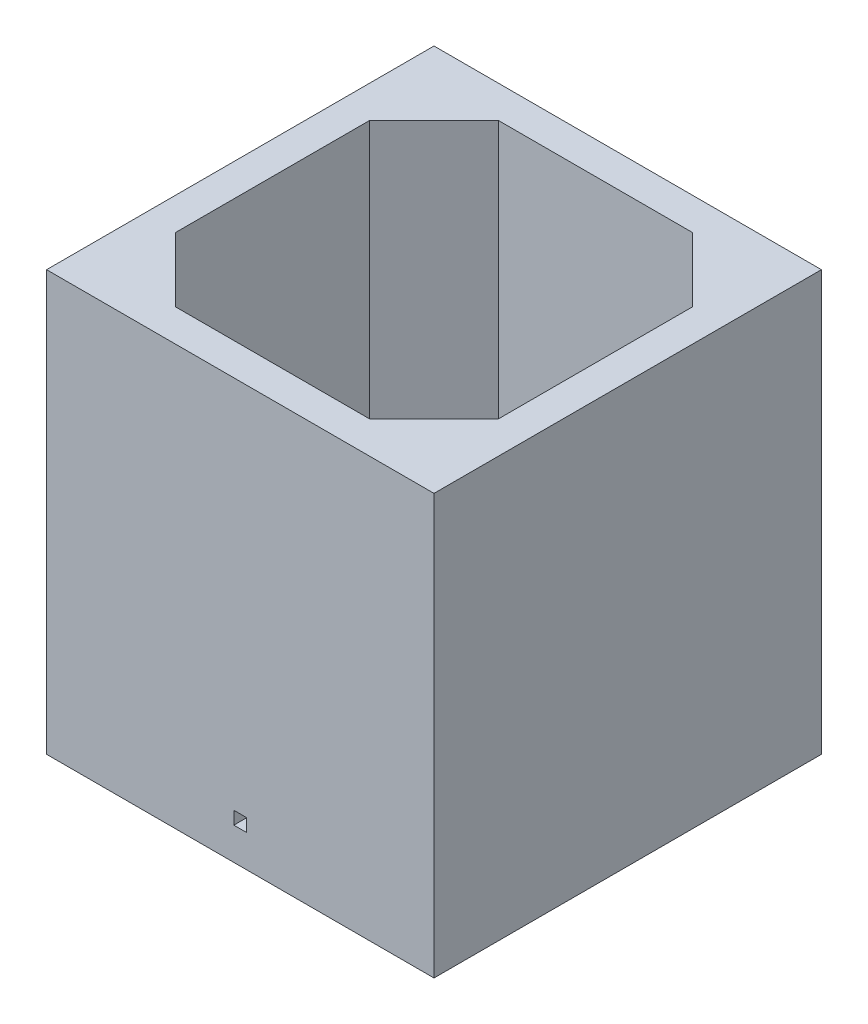
ISO-10303-21;
HEADER;
FILE_DESCRIPTION(('STEP AP214'),'2;1');
FILE_NAME('part.step','',(''),(''),'','','');
FILE_SCHEMA(('AUTOMOTIVE_DESIGN { 1 0 10303 214 1 1 1 1 }'));
ENDSEC;
DATA;
#1=APPLICATION_CONTEXT('core data for automotive mechanical design processes');
#2=APPLICATION_PROTOCOL_DEFINITION('international standard','automotive_design',2000,#1);
#3=PRODUCT_CONTEXT('',#1,'mechanical');
#4=PRODUCT('Part','Part','',(#3));
#5=PRODUCT_RELATED_PRODUCT_CATEGORY('part','',(#4));
#6=PRODUCT_DEFINITION_FORMATION('','',#4);
#7=PRODUCT_DEFINITION_CONTEXT('part definition',#1,'design');
#8=PRODUCT_DEFINITION('design','',#6,#7);
#9=PRODUCT_DEFINITION_SHAPE('','',#8);
#10=(LENGTH_UNIT() NAMED_UNIT(*) SI_UNIT(.MILLI.,.METRE.));
#11=(NAMED_UNIT(*) PLANE_ANGLE_UNIT() SI_UNIT($,.RADIAN.));
#12=(NAMED_UNIT(*) SI_UNIT($,.STERADIAN.) SOLID_ANGLE_UNIT());
#13=UNCERTAINTY_MEASURE_WITH_UNIT(LENGTH_MEASURE(1.E-05),#10,'distance_accuracy_value','');
#14=(GEOMETRIC_REPRESENTATION_CONTEXT(3) GLOBAL_UNCERTAINTY_ASSIGNED_CONTEXT((#13)) GLOBAL_UNIT_ASSIGNED_CONTEXT((#10,
#11,#12)) REPRESENTATION_CONTEXT('',''));
#15=CARTESIAN_POINT('',(0.,0.,0.));
#16=DIRECTION('',(0.,0.,1.));
#17=DIRECTION('',(1.,0.,0.));
#18=AXIS2_PLACEMENT_3D('',#15,#16,#17);
#19=CARTESIAN_POINT('',(0.,60.,0.));
#20=DIRECTION('',(0.,-1.,0.));
#21=DIRECTION('',(0.,0.,-1.));
#22=AXIS2_PLACEMENT_3D('',#19,#20,#21);
#23=PLANE('',#22);
#24=DIRECTION('',(0.,0.,-1.));
#25=VECTOR('',#24,1.);
#26=CARTESIAN_POINT('',(30.,60.,30.));
#27=LINE('',#26,#25);
#28=CARTESIAN_POINT('',(30.,60.,30.));
#29=VERTEX_POINT('',#28);
#30=CARTESIAN_POINT('',(30.,60.,-30.));
#31=VERTEX_POINT('',#30);
#32=EDGE_CURVE('E179',#29,#31,#27,.T.);
#33=ORIENTED_EDGE('',*,*,#32,.T.);
#34=DIRECTION('',(-1.,0.,0.));
#35=VECTOR('',#34,1.);
#36=CARTESIAN_POINT('',(-30.,60.,-30.));
#37=LINE('',#36,#35);
#38=CARTESIAN_POINT('',(-30.,60.,-30.));
#39=VERTEX_POINT('',#38);
#40=EDGE_CURVE('E182',#31,#39,#37,.T.);
#41=ORIENTED_EDGE('',*,*,#40,.T.);
#42=DIRECTION('',(0.,0.,1.));
#43=VECTOR('',#42,1.);
#44=CARTESIAN_POINT('',(-30.,60.,30.));
#45=LINE('',#44,#43);
#46=CARTESIAN_POINT('',(-30.,60.,30.));
#47=VERTEX_POINT('',#46);
#48=EDGE_CURVE('E185',#39,#47,#45,.T.);
#49=ORIENTED_EDGE('',*,*,#48,.T.);
#50=DIRECTION('',(1.,0.,0.));
#51=VECTOR('',#50,1.);
#52=CARTESIAN_POINT('',(-30.,60.,30.));
#53=LINE('',#52,#51);
#54=EDGE_CURVE('E187',#47,#29,#53,.T.);
#55=ORIENTED_EDGE('',*,*,#54,.T.);
#56=EDGE_LOOP('',(#33,#41,#49,#55));
#57=FACE_BOUND('',#56,.T.);
#58=DIRECTION('',(0.,0.,-1.));
#59=VECTOR('',#58,1.);
#60=CARTESIAN_POINT('',(25.,60.,25.));
#61=LINE('',#60,#59);
#62=CARTESIAN_POINT('',(25.,60.,15.));
#63=VERTEX_POINT('',#62);
#64=CARTESIAN_POINT('',(25.,60.,-14.9999999999999));
#65=VERTEX_POINT('',#64);
#66=EDGE_CURVE('E169',#63,#65,#61,.T.);
#67=ORIENTED_EDGE('',*,*,#66,.F.);
#68=DIRECTION('',(0.707106781186551,0.,-0.707106781186544));
#69=VECTOR('',#68,1.);
#70=CARTESIAN_POINT('',(19.9999999999999,60.,20.0000000000001));
#71=LINE('',#70,#69);
#72=CARTESIAN_POINT('',(14.9999999999999,60.,25.));
#73=VERTEX_POINT('',#72);
#74=EDGE_CURVE('E11',#63,#73,#71,.F.);
#75=ORIENTED_EDGE('',*,*,#74,.T.);
#76=DIRECTION('',(1.,0.,0.));
#77=VECTOR('',#76,1.);
#78=CARTESIAN_POINT('',(-25.,60.,25.));
#79=LINE('',#78,#77);
#80=CARTESIAN_POINT('',(-15.,60.,25.));
#81=VERTEX_POINT('',#80);
#82=EDGE_CURVE('E183',#81,#73,#79,.T.);
#83=ORIENTED_EDGE('',*,*,#82,.F.);
#84=DIRECTION('',(0.707106781186544,0.,0.707106781186551));
#85=VECTOR('',#84,1.);
#86=CARTESIAN_POINT('',(-20.0000000000001,60.,19.9999999999999));
#87=LINE('',#86,#85);
#88=CARTESIAN_POINT('',(-25.,60.,14.9999999999999));
#89=VERTEX_POINT('',#88);
#90=EDGE_CURVE('E224',#81,#89,#87,.F.);
#91=ORIENTED_EDGE('',*,*,#90,.T.);
#92=DIRECTION('',(0.,0.,1.));
#93=VECTOR('',#92,1.);
#94=CARTESIAN_POINT('',(-25.,60.,25.));
#95=LINE('',#94,#93);
#96=CARTESIAN_POINT('',(-25.,60.,-15.));
#97=VERTEX_POINT('',#96);
#98=EDGE_CURVE('E254',#97,#89,#95,.T.);
#99=ORIENTED_EDGE('',*,*,#98,.F.);
#100=DIRECTION('',(-0.707106781186551,0.,0.707106781186544));
#101=VECTOR('',#100,1.);
#102=CARTESIAN_POINT('',(-19.9999999999999,60.,-20.0000000000001));
#103=LINE('',#102,#101);
#104=CARTESIAN_POINT('',(-14.9999999999999,60.,-25.));
#105=VERTEX_POINT('',#104);
#106=EDGE_CURVE('E226',#97,#105,#103,.F.);
#107=ORIENTED_EDGE('',*,*,#106,.T.);
#108=DIRECTION('',(-1.,0.,0.));
#109=VECTOR('',#108,1.);
#110=CARTESIAN_POINT('',(-25.,60.,-25.));
#111=LINE('',#110,#109);
#112=CARTESIAN_POINT('',(15.,60.,-25.));
#113=VERTEX_POINT('',#112);
#114=EDGE_CURVE('E173',#113,#105,#111,.T.);
#115=ORIENTED_EDGE('',*,*,#114,.F.);
#116=DIRECTION('',(-0.707106781186544,0.,-0.707106781186551));
#117=VECTOR('',#116,1.);
#118=CARTESIAN_POINT('',(20.0000000000001,60.,-19.9999999999999));
#119=LINE('',#118,#117);
#120=EDGE_CURVE('E44',#113,#65,#119,.F.);
#121=ORIENTED_EDGE('',*,*,#120,.T.);
#122=EDGE_LOOP('',(#67,#75,#83,#91,#99,#107,#115,#121));
#123=FACE_BOUND('',#122,.T.);
#124=ADVANCED_FACE('F35',(#57,#123),#23,.F.);
#125=CARTESIAN_POINT('',(30.,60.,30.));
#126=DIRECTION('',(-1.,0.,0.));
#127=DIRECTION('',(0.,0.,1.));
#128=AXIS2_PLACEMENT_3D('',#125,#126,#127);
#129=PLANE('',#128);
#130=DIRECTION('',(0.,-1.,0.));
#131=VECTOR('',#130,1.);
#132=CARTESIAN_POINT('',(30.,60.,30.));
#133=LINE('',#132,#131);
#134=CARTESIAN_POINT('',(30.,-5.,30.));
#135=VERTEX_POINT('',#134);
#136=EDGE_CURVE('E189',#29,#135,#133,.T.);
#137=ORIENTED_EDGE('',*,*,#136,.T.);
#138=DIRECTION('',(0.,0.,1.));
#139=VECTOR('',#138,1.);
#140=CARTESIAN_POINT('',(30.,-5.,-30.));
#141=LINE('',#140,#139);
#142=CARTESIAN_POINT('',(30.,-5.,-30.));
#143=VERTEX_POINT('',#142);
#144=EDGE_CURVE('E266',#143,#135,#141,.T.);
#145=ORIENTED_EDGE('',*,*,#144,.F.);
#146=DIRECTION('',(0.,-1.,0.));
#147=VECTOR('',#146,1.);
#148=CARTESIAN_POINT('',(30.,60.,-30.));
#149=LINE('',#148,#147);
#150=EDGE_CURVE('E195',#31,#143,#149,.T.);
#151=ORIENTED_EDGE('',*,*,#150,.F.);
#152=ORIENTED_EDGE('',*,*,#32,.F.);
#153=EDGE_LOOP('',(#137,#145,#151,#152));
#154=FACE_BOUND('',#153,.T.);
#155=ADVANCED_FACE('F329',(#154),#129,.F.);
#156=CARTESIAN_POINT('',(-30.,60.,-30.));
#157=DIRECTION('',(0.,0.,1.));
#158=DIRECTION('',(1.,0.,0.));
#159=AXIS2_PLACEMENT_3D('',#156,#157,#158);
#160=PLANE('',#159);
#161=CARTESIAN_POINT('',(13.1765280058509,8.1,-30.));
#162=DIRECTION('',(0.,0.,-1.));
#163=DIRECTION('',(-1.,0.,0.));
#164=AXIS2_PLACEMENT_3D('',#161,#162,#163);
#165=CIRCLE('',#164,1.25);
#166=CARTESIAN_POINT('',(11.9265280058509,8.1,-30.));
#167=VERTEX_POINT('',#166);
#168=EDGE_CURVE('E277',#167,#167,#165,.T.);
#169=ORIENTED_EDGE('',*,*,#168,.F.);
#170=EDGE_LOOP('',(#169));
#171=FACE_BOUND('',#170,.T.);
#172=CARTESIAN_POINT('',(0.,2.5,-30.));
#173=DIRECTION('',(0.,0.,-1.));
#174=DIRECTION('',(-1.,0.,0.));
#175=AXIS2_PLACEMENT_3D('',#172,#173,#174);
#176=CIRCLE('',#175,1.25);
#177=CARTESIAN_POINT('',(-1.24999999999999,2.5,-30.));
#178=VERTEX_POINT('',#177);
#179=EDGE_CURVE('E273',#178,#178,#176,.T.);
#180=ORIENTED_EDGE('',*,*,#179,.F.);
#181=EDGE_LOOP('',(#180));
#182=FACE_BOUND('',#181,.T.);
#183=CARTESIAN_POINT('',(0.,8.1,-30.));
#184=DIRECTION('',(0.,0.,-1.));
#185=DIRECTION('',(-1.,0.,0.));
#186=AXIS2_PLACEMENT_3D('',#183,#184,#185);
#187=CIRCLE('',#186,1.25);
#188=CARTESIAN_POINT('',(-1.24999999999999,8.1,-30.));
#189=VERTEX_POINT('',#188);
#190=EDGE_CURVE('E274',#189,#189,#187,.T.);
#191=ORIENTED_EDGE('',*,*,#190,.F.);
#192=EDGE_LOOP('',(#191));
#193=FACE_BOUND('',#192,.T.);
#194=ORIENTED_EDGE('',*,*,#150,.T.);
#195=DIRECTION('',(1.,0.,0.));
#196=VECTOR('',#195,1.);
#197=CARTESIAN_POINT('',(-30.,-5.,-30.));
#198=LINE('',#197,#196);
#199=CARTESIAN_POINT('',(-30.,-5.,-30.));
#200=VERTEX_POINT('',#199);
#201=EDGE_CURVE('E249',#200,#143,#198,.T.);
#202=ORIENTED_EDGE('',*,*,#201,.F.);
#203=DIRECTION('',(0.,-1.,0.));
#204=VECTOR('',#203,1.);
#205=CARTESIAN_POINT('',(-30.,60.,-30.));
#206=LINE('',#205,#204);
#207=EDGE_CURVE('E193',#39,#200,#206,.T.);
#208=ORIENTED_EDGE('',*,*,#207,.F.);
#209=ORIENTED_EDGE('',*,*,#40,.F.);
#210=EDGE_LOOP('',(#194,#202,#208,#209));
#211=FACE_BOUND('',#210,.T.);
#212=ADVANCED_FACE('F326',(#171,#182,#193,#211),#160,.F.);
#213=CARTESIAN_POINT('',(-30.,60.,30.));
#214=DIRECTION('',(1.,0.,0.));
#215=DIRECTION('',(0.,0.,-1.));
#216=AXIS2_PLACEMENT_3D('',#213,#214,#215);
#217=PLANE('',#216);
#218=ORIENTED_EDGE('',*,*,#207,.T.);
#219=DIRECTION('',(0.,0.,-1.));
#220=VECTOR('',#219,1.);
#221=CARTESIAN_POINT('',(-30.,-5.,-30.));
#222=LINE('',#221,#220);
#223=CARTESIAN_POINT('',(-30.,-5.,30.));
#224=VERTEX_POINT('',#223);
#225=EDGE_CURVE('E260',#224,#200,#222,.T.);
#226=ORIENTED_EDGE('',*,*,#225,.F.);
#227=DIRECTION('',(0.,-1.,0.));
#228=VECTOR('',#227,1.);
#229=CARTESIAN_POINT('',(-30.,60.,30.));
#230=LINE('',#229,#228);
#231=EDGE_CURVE('E191',#47,#224,#230,.T.);
#232=ORIENTED_EDGE('',*,*,#231,.F.);
#233=ORIENTED_EDGE('',*,*,#48,.F.);
#234=EDGE_LOOP('',(#218,#226,#232,#233));
#235=FACE_BOUND('',#234,.T.);
#236=ADVANCED_FACE('F311',(#235),#217,.F.);
#237=CARTESIAN_POINT('',(-30.,60.,30.));
#238=DIRECTION('',(0.,0.,-1.));
#239=DIRECTION('',(-1.,0.,0.));
#240=AXIS2_PLACEMENT_3D('',#237,#238,#239);
#241=PLANE('',#240);
#242=DIRECTION('',(0.,1.,0.));
#243=VECTOR('',#242,1.);
#244=CARTESIAN_POINT('',(1.,0.,30.));
#245=LINE('',#244,#243);
#246=CARTESIAN_POINT('',(1.,0.,30.));
#247=VERTEX_POINT('',#246);
#248=CARTESIAN_POINT('',(1.,2.,30.));
#249=VERTEX_POINT('',#248);
#250=EDGE_CURVE('E293',#247,#249,#245,.T.);
#251=ORIENTED_EDGE('',*,*,#250,.F.);
#252=DIRECTION('',(1.,0.,0.));
#253=VECTOR('',#252,1.);
#254=CARTESIAN_POINT('',(-0.999999999999999,0.,30.));
#255=LINE('',#254,#253);
#256=CARTESIAN_POINT('',(-0.999999999999999,0.,30.));
#257=VERTEX_POINT('',#256);
#258=EDGE_CURVE('E296',#257,#247,#255,.T.);
#259=ORIENTED_EDGE('',*,*,#258,.F.);
#260=DIRECTION('',(0.,-1.,0.));
#261=VECTOR('',#260,1.);
#262=CARTESIAN_POINT('',(-0.999999999999999,0.,30.));
#263=LINE('',#262,#261);
#264=CARTESIAN_POINT('',(-1.,2.,30.));
#265=VERTEX_POINT('',#264);
#266=EDGE_CURVE('E153',#265,#257,#263,.T.);
#267=ORIENTED_EDGE('',*,*,#266,.F.);
#268=DIRECTION('',(-1.,0.,0.));
#269=VECTOR('',#268,1.);
#270=CARTESIAN_POINT('',(-1.,2.,30.));
#271=LINE('',#270,#269);
#272=EDGE_CURVE('E51',#249,#265,#271,.T.);
#273=ORIENTED_EDGE('',*,*,#272,.F.);
#274=EDGE_LOOP('',(#251,#259,#267,#273));
#275=FACE_BOUND('',#274,.T.);
#276=ORIENTED_EDGE('',*,*,#231,.T.);
#277=DIRECTION('',(-1.,0.,0.));
#278=VECTOR('',#277,1.);
#279=CARTESIAN_POINT('',(-30.,-5.,30.));
#280=LINE('',#279,#278);
#281=EDGE_CURVE('E263',#135,#224,#280,.T.);
#282=ORIENTED_EDGE('',*,*,#281,.F.);
#283=ORIENTED_EDGE('',*,*,#136,.F.);
#284=ORIENTED_EDGE('',*,*,#54,.F.);
#285=EDGE_LOOP('',(#276,#282,#283,#284));
#286=FACE_BOUND('',#285,.T.);
#287=ADVANCED_FACE('F308',(#275,#286),#241,.F.);
#288=CARTESIAN_POINT('',(25.,60.,25.));
#289=DIRECTION('',(-1.,0.,0.));
#290=DIRECTION('',(0.,0.,1.));
#291=AXIS2_PLACEMENT_3D('',#288,#289,#290);
#292=PLANE('',#291);
#293=ORIENTED_EDGE('',*,*,#66,.T.);
#294=DIRECTION('',(0.,-1.,0.));
#295=VECTOR('',#294,1.);
#296=CARTESIAN_POINT('',(25.,0.,-14.9999999999999));
#297=LINE('',#296,#295);
#298=CARTESIAN_POINT('',(25.,0.,-14.9999999999999));
#299=VERTEX_POINT('',#298);
#300=EDGE_CURVE('E221',#65,#299,#297,.T.);
#301=ORIENTED_EDGE('',*,*,#300,.T.);
#302=DIRECTION('',(0.,0.,-1.));
#303=VECTOR('',#302,1.);
#304=CARTESIAN_POINT('',(25.,0.,25.));
#305=LINE('',#304,#303);
#306=CARTESIAN_POINT('',(25.,0.,15.));
#307=VERTEX_POINT('',#306);
#308=EDGE_CURVE('E245',#307,#299,#305,.T.);
#309=ORIENTED_EDGE('',*,*,#308,.F.);
#310=DIRECTION('',(0.,1.,0.));
#311=VECTOR('',#310,1.);
#312=CARTESIAN_POINT('',(25.,60.,15.));
#313=LINE('',#312,#311);
#314=EDGE_CURVE('E219',#307,#63,#313,.T.);
#315=ORIENTED_EDGE('',*,*,#314,.T.);
#316=EDGE_LOOP('',(#293,#301,#309,#315));
#317=FACE_BOUND('',#316,.T.);
#318=ADVANCED_FACE('F237',(#317),#292,.T.);
#319=CARTESIAN_POINT('',(-25.,60.,-25.));
#320=DIRECTION('',(0.,0.,1.));
#321=DIRECTION('',(1.,0.,0.));
#322=AXIS2_PLACEMENT_3D('',#319,#320,#321);
#323=PLANE('',#322);
#324=CARTESIAN_POINT('',(13.1765280058509,8.1,-25.));
#325=DIRECTION('',(0.,0.,1.));
#326=DIRECTION('',(1.,0.,0.));
#327=AXIS2_PLACEMENT_3D('',#324,#325,#326);
#328=CIRCLE('',#327,1.25);
#329=CARTESIAN_POINT('',(14.4265280058509,8.1,-25.));
#330=VERTEX_POINT('',#329);
#331=EDGE_CURVE('E284',#330,#330,#328,.F.);
#332=ORIENTED_EDGE('',*,*,#331,.T.);
#333=EDGE_LOOP('',(#332));
#334=FACE_BOUND('',#333,.T.);
#335=CARTESIAN_POINT('',(0.,2.5,-25.));
#336=DIRECTION('',(0.,0.,1.));
#337=DIRECTION('',(1.,0.,0.));
#338=AXIS2_PLACEMENT_3D('',#335,#336,#337);
#339=CIRCLE('',#338,1.25);
#340=CARTESIAN_POINT('',(1.25000000000001,2.5,-25.));
#341=VERTEX_POINT('',#340);
#342=EDGE_CURVE('E269',#341,#341,#339,.F.);
#343=ORIENTED_EDGE('',*,*,#342,.T.);
#344=EDGE_LOOP('',(#343));
#345=FACE_BOUND('',#344,.T.);
#346=CARTESIAN_POINT('',(0.,8.1,-25.));
#347=DIRECTION('',(0.,0.,1.));
#348=DIRECTION('',(1.,0.,0.));
#349=AXIS2_PLACEMENT_3D('',#346,#347,#348);
#350=CIRCLE('',#349,1.25);
#351=CARTESIAN_POINT('',(1.25000000000001,8.1,-25.));
#352=VERTEX_POINT('',#351);
#353=EDGE_CURVE('E270',#352,#352,#350,.F.);
#354=ORIENTED_EDGE('',*,*,#353,.T.);
#355=EDGE_LOOP('',(#354));
#356=FACE_BOUND('',#355,.T.);
#357=ORIENTED_EDGE('',*,*,#114,.T.);
#358=DIRECTION('',(0.,-1.,0.));
#359=VECTOR('',#358,1.);
#360=CARTESIAN_POINT('',(-14.9999999999999,0.,-25.));
#361=LINE('',#360,#359);
#362=CARTESIAN_POINT('',(-14.9999999999999,0.,-25.));
#363=VERTEX_POINT('',#362);
#364=EDGE_CURVE('E216',#105,#363,#361,.T.);
#365=ORIENTED_EDGE('',*,*,#364,.T.);
#366=DIRECTION('',(-1.,0.,0.));
#367=VECTOR('',#366,1.);
#368=CARTESIAN_POINT('',(-25.,0.,-25.));
#369=LINE('',#368,#367);
#370=CARTESIAN_POINT('',(15.,0.,-25.));
#371=VERTEX_POINT('',#370);
#372=EDGE_CURVE('E244',#371,#363,#369,.T.);
#373=ORIENTED_EDGE('',*,*,#372,.F.);
#374=DIRECTION('',(0.,1.,0.));
#375=VECTOR('',#374,1.);
#376=CARTESIAN_POINT('',(15.,60.,-25.));
#377=LINE('',#376,#375);
#378=EDGE_CURVE('E214',#371,#113,#377,.T.);
#379=ORIENTED_EDGE('',*,*,#378,.T.);
#380=EDGE_LOOP('',(#357,#365,#373,#379));
#381=FACE_BOUND('',#380,.T.);
#382=ADVANCED_FACE('F247',(#334,#345,#356,#381),#323,.T.);
#383=CARTESIAN_POINT('',(-25.,60.,25.));
#384=DIRECTION('',(1.,0.,0.));
#385=DIRECTION('',(0.,0.,-1.));
#386=AXIS2_PLACEMENT_3D('',#383,#384,#385);
#387=PLANE('',#386);
#388=ORIENTED_EDGE('',*,*,#98,.T.);
#389=DIRECTION('',(0.,-1.,0.));
#390=VECTOR('',#389,1.);
#391=CARTESIAN_POINT('',(-25.,0.,14.9999999999999));
#392=LINE('',#391,#390);
#393=CARTESIAN_POINT('',(-25.,0.,14.9999999999999));
#394=VERTEX_POINT('',#393);
#395=EDGE_CURVE('E199',#89,#394,#392,.T.);
#396=ORIENTED_EDGE('',*,*,#395,.T.);
#397=DIRECTION('',(0.,0.,1.));
#398=VECTOR('',#397,1.);
#399=CARTESIAN_POINT('',(-25.,0.,25.));
#400=LINE('',#399,#398);
#401=CARTESIAN_POINT('',(-25.,0.,-15.));
#402=VERTEX_POINT('',#401);
#403=EDGE_CURVE('E175',#402,#394,#400,.T.);
#404=ORIENTED_EDGE('',*,*,#403,.F.);
#405=DIRECTION('',(0.,1.,0.));
#406=VECTOR('',#405,1.);
#407=CARTESIAN_POINT('',(-25.,60.,-15.));
#408=LINE('',#407,#406);
#409=EDGE_CURVE('E197',#402,#97,#408,.T.);
#410=ORIENTED_EDGE('',*,*,#409,.T.);
#411=EDGE_LOOP('',(#388,#396,#404,#410));
#412=FACE_BOUND('',#411,.T.);
#413=ADVANCED_FACE('F382',(#412),#387,.T.);
#414=CARTESIAN_POINT('',(-25.,60.,25.));
#415=DIRECTION('',(0.,0.,-1.));
#416=DIRECTION('',(-1.,0.,0.));
#417=AXIS2_PLACEMENT_3D('',#414,#415,#416);
#418=PLANE('',#417);
#419=DIRECTION('',(0.,1.,0.));
#420=VECTOR('',#419,1.);
#421=CARTESIAN_POINT('',(1.,0.,25.));
#422=LINE('',#421,#420);
#423=CARTESIAN_POINT('',(1.,0.,25.));
#424=VERTEX_POINT('',#423);
#425=CARTESIAN_POINT('',(1.,2.,25.));
#426=VERTEX_POINT('',#425);
#427=EDGE_CURVE('E300',#424,#426,#422,.T.);
#428=ORIENTED_EDGE('',*,*,#427,.T.);
#429=DIRECTION('',(-1.,0.,0.));
#430=VECTOR('',#429,1.);
#431=CARTESIAN_POINT('',(-1.,2.,25.));
#432=LINE('',#431,#430);
#433=CARTESIAN_POINT('',(-1.,2.,25.));
#434=VERTEX_POINT('',#433);
#435=EDGE_CURVE('E164',#426,#434,#432,.T.);
#436=ORIENTED_EDGE('',*,*,#435,.T.);
#437=DIRECTION('',(0.,-1.,0.));
#438=VECTOR('',#437,1.);
#439=CARTESIAN_POINT('',(-0.999999999999999,0.,25.));
#440=LINE('',#439,#438);
#441=CARTESIAN_POINT('',(-0.999999999999997,0.,25.));
#442=VERTEX_POINT('',#441);
#443=EDGE_CURVE('E151',#434,#442,#440,.T.);
#444=ORIENTED_EDGE('',*,*,#443,.T.);
#445=DIRECTION('',(1.,0.,0.));
#446=VECTOR('',#445,1.);
#447=CARTESIAN_POINT('',(-25.,0.,25.));
#448=LINE('',#447,#446);
#449=CARTESIAN_POINT('',(-15.,0.,25.));
#450=VERTEX_POINT('',#449);
#451=EDGE_CURVE('E162',#450,#442,#448,.T.);
#452=ORIENTED_EDGE('',*,*,#451,.F.);
#453=DIRECTION('',(0.,1.,0.));
#454=VECTOR('',#453,1.);
#455=CARTESIAN_POINT('',(-15.,60.,25.));
#456=LINE('',#455,#454);
#457=EDGE_CURVE('E212',#450,#81,#456,.T.);
#458=ORIENTED_EDGE('',*,*,#457,.T.);
#459=ORIENTED_EDGE('',*,*,#82,.T.);
#460=DIRECTION('',(0.,-1.,0.));
#461=VECTOR('',#460,1.);
#462=CARTESIAN_POINT('',(14.9999999999999,0.,25.));
#463=LINE('',#462,#461);
#464=CARTESIAN_POINT('',(14.9999999999999,0.,25.));
#465=VERTEX_POINT('',#464);
#466=EDGE_CURVE('E209',#73,#465,#463,.T.);
#467=ORIENTED_EDGE('',*,*,#466,.T.);
#468=EDGE_CURVE('E170',#424,#465,#448,.T.);
#469=ORIENTED_EDGE('',*,*,#468,.F.);
#470=EDGE_LOOP('',(#428,#436,#444,#452,#458,#459,#467,#469));
#471=FACE_BOUND('',#470,.T.);
#472=ADVANCED_FACE('F161',(#471),#418,.T.);
#473=CARTESIAN_POINT('',(0.,0.,0.));
#474=DIRECTION('',(0.,1.,0.));
#475=DIRECTION('',(0.,0.,1.));
#476=AXIS2_PLACEMENT_3D('',#473,#474,#475);
#477=PLANE('',#476);
#478=ORIENTED_EDGE('',*,*,#403,.T.);
#479=DIRECTION('',(-0.707106781186544,0.,-0.707106781186551));
#480=VECTOR('',#479,1.);
#481=CARTESIAN_POINT('',(-20.0000000000001,0.,19.9999999999999));
#482=LINE('',#481,#480);
#483=EDGE_CURVE('E168',#394,#450,#482,.F.);
#484=ORIENTED_EDGE('',*,*,#483,.T.);
#485=ORIENTED_EDGE('',*,*,#451,.T.);
#486=DIRECTION('',(0.,0.,1.));
#487=VECTOR('',#486,1.);
#488=CARTESIAN_POINT('',(-0.999999999999999,0.,-30.001));
#489=LINE('',#488,#487);
#490=EDGE_CURVE('E148',#442,#257,#489,.T.);
#491=ORIENTED_EDGE('',*,*,#490,.T.);
#492=ORIENTED_EDGE('',*,*,#258,.T.);
#493=DIRECTION('',(0.,0.,1.));
#494=VECTOR('',#493,1.);
#495=CARTESIAN_POINT('',(1.,0.,-30.001));
#496=LINE('',#495,#494);
#497=EDGE_CURVE('E59',#424,#247,#496,.T.);
#498=ORIENTED_EDGE('',*,*,#497,.F.);
#499=ORIENTED_EDGE('',*,*,#468,.T.);
#500=DIRECTION('',(-0.707106781186551,0.,0.707106781186544));
#501=VECTOR('',#500,1.);
#502=CARTESIAN_POINT('',(19.9999999999999,0.,20.0000000000001));
#503=LINE('',#502,#501);
#504=EDGE_CURVE('E202',#465,#307,#503,.F.);
#505=ORIENTED_EDGE('',*,*,#504,.T.);
#506=ORIENTED_EDGE('',*,*,#308,.T.);
#507=DIRECTION('',(0.707106781186544,0.,0.707106781186551));
#508=VECTOR('',#507,1.);
#509=CARTESIAN_POINT('',(20.0000000000001,0.,-19.9999999999999));
#510=LINE('',#509,#508);
#511=EDGE_CURVE('E204',#299,#371,#510,.F.);
#512=ORIENTED_EDGE('',*,*,#511,.T.);
#513=ORIENTED_EDGE('',*,*,#372,.T.);
#514=DIRECTION('',(0.707106781186551,0.,-0.707106781186544));
#515=VECTOR('',#514,1.);
#516=CARTESIAN_POINT('',(-19.9999999999999,0.,-20.0000000000001));
#517=LINE('',#516,#515);
#518=EDGE_CURVE('E206',#363,#402,#517,.F.);
#519=ORIENTED_EDGE('',*,*,#518,.T.);
#520=EDGE_LOOP('',(#478,#484,#485,#491,#492,#498,#499,#505,#506,#512,#513,#519));
#521=FACE_BOUND('',#520,.T.);
#522=ADVANCED_FACE('F167',(#521),#477,.T.);
#523=CARTESIAN_POINT('',(0.,-5.,0.));
#524=DIRECTION('',(0.,1.,0.));
#525=DIRECTION('',(0.,0.,1.));
#526=AXIS2_PLACEMENT_3D('',#523,#524,#525);
#527=PLANE('',#526);
#528=ORIENTED_EDGE('',*,*,#144,.T.);
#529=ORIENTED_EDGE('',*,*,#281,.T.);
#530=ORIENTED_EDGE('',*,*,#225,.T.);
#531=ORIENTED_EDGE('',*,*,#201,.T.);
#532=EDGE_LOOP('',(#528,#529,#530,#531));
#533=FACE_BOUND('',#532,.T.);
#534=ADVANCED_FACE('F321',(#533),#527,.F.);
#535=CARTESIAN_POINT('',(0.,8.1,-21.4644660940673));
#536=DIRECTION('',(0.,0.,-1.));
#537=DIRECTION('',(-1.,0.,0.));
#538=AXIS2_PLACEMENT_3D('',#535,#536,#537);
#539=CYLINDRICAL_SURFACE('',#538,1.25);
#540=ORIENTED_EDGE('',*,*,#190,.T.);
#541=EDGE_LOOP('',(#540));
#542=FACE_BOUND('',#541,.T.);
#543=ORIENTED_EDGE('',*,*,#353,.F.);
#544=EDGE_LOOP('',(#543));
#545=FACE_BOUND('',#544,.T.);
#546=ADVANCED_FACE('F399',(#542,#545),#539,.F.);
#547=CARTESIAN_POINT('',(0.,2.5,-21.4644660940673));
#548=DIRECTION('',(0.,0.,-1.));
#549=DIRECTION('',(-1.,0.,0.));
#550=AXIS2_PLACEMENT_3D('',#547,#548,#549);
#551=CYLINDRICAL_SURFACE('',#550,1.25);
#552=ORIENTED_EDGE('',*,*,#179,.T.);
#553=EDGE_LOOP('',(#552));
#554=FACE_BOUND('',#553,.T.);
#555=ORIENTED_EDGE('',*,*,#342,.F.);
#556=EDGE_LOOP('',(#555));
#557=FACE_BOUND('',#556,.T.);
#558=ADVANCED_FACE('F402',(#554,#557),#551,.F.);
#559=CARTESIAN_POINT('',(13.1765280058509,8.1,30.001));
#560=DIRECTION('',(0.,0.,-1.));
#561=DIRECTION('',(-1.,0.,0.));
#562=AXIS2_PLACEMENT_3D('',#559,#560,#561);
#563=CYLINDRICAL_SURFACE('',#562,1.25);
#564=ORIENTED_EDGE('',*,*,#331,.F.);
#565=EDGE_LOOP('',(#564));
#566=FACE_BOUND('',#565,.T.);
#567=ORIENTED_EDGE('',*,*,#168,.T.);
#568=EDGE_LOOP('',(#567));
#569=FACE_BOUND('',#568,.T.);
#570=ADVANCED_FACE('F356',(#566,#569),#563,.F.);
#571=CARTESIAN_POINT('',(-25.,60.,14.9999999999999));
#572=DIRECTION('',(0.707106781186552,0.,-0.707106781186544));
#573=DIRECTION('',(0.,1.,0.));
#574=AXIS2_PLACEMENT_3D('',#571,#572,#573);
#575=PLANE('',#574);
#576=ORIENTED_EDGE('',*,*,#90,.F.);
#577=ORIENTED_EDGE('',*,*,#457,.F.);
#578=ORIENTED_EDGE('',*,*,#483,.F.);
#579=ORIENTED_EDGE('',*,*,#395,.F.);
#580=EDGE_LOOP('',(#576,#577,#578,#579));
#581=FACE_BOUND('',#580,.T.);
#582=ADVANCED_FACE('F349',(#581),#575,.T.);
#583=CARTESIAN_POINT('',(-14.9999999999999,60.,-25.));
#584=DIRECTION('',(0.707106781186543,0.,0.707106781186551));
#585=DIRECTION('',(0.,1.,0.));
#586=AXIS2_PLACEMENT_3D('',#583,#584,#585);
#587=PLANE('',#586);
#588=ORIENTED_EDGE('',*,*,#106,.F.);
#589=ORIENTED_EDGE('',*,*,#409,.F.);
#590=ORIENTED_EDGE('',*,*,#518,.F.);
#591=ORIENTED_EDGE('',*,*,#364,.F.);
#592=EDGE_LOOP('',(#588,#589,#590,#591));
#593=FACE_BOUND('',#592,.T.);
#594=ADVANCED_FACE('F355',(#593),#587,.T.);
#595=CARTESIAN_POINT('',(25.,60.,-14.9999999999999));
#596=DIRECTION('',(-0.707106781186552,0.,0.707106781186544));
#597=DIRECTION('',(0.,1.,0.));
#598=AXIS2_PLACEMENT_3D('',#595,#596,#597);
#599=PLANE('',#598);
#600=ORIENTED_EDGE('',*,*,#120,.F.);
#601=ORIENTED_EDGE('',*,*,#378,.F.);
#602=ORIENTED_EDGE('',*,*,#511,.F.);
#603=ORIENTED_EDGE('',*,*,#300,.F.);
#604=EDGE_LOOP('',(#600,#601,#602,#603));
#605=FACE_BOUND('',#604,.T.);
#606=ADVANCED_FACE('F241',(#605),#599,.T.);
#607=CARTESIAN_POINT('',(14.9999999999999,60.,25.));
#608=DIRECTION('',(-0.707106781186544,0.,-0.707106781186551));
#609=DIRECTION('',(0.,1.,0.));
#610=AXIS2_PLACEMENT_3D('',#607,#608,#609);
#611=PLANE('',#610);
#612=ORIENTED_EDGE('',*,*,#74,.F.);
#613=ORIENTED_EDGE('',*,*,#314,.F.);
#614=ORIENTED_EDGE('',*,*,#504,.F.);
#615=ORIENTED_EDGE('',*,*,#466,.F.);
#616=EDGE_LOOP('',(#612,#613,#614,#615));
#617=FACE_BOUND('',#616,.T.);
#618=ADVANCED_FACE('F38',(#617),#611,.T.);
#619=CARTESIAN_POINT('',(1.,0.,-30.001));
#620=DIRECTION('',(1.,0.,0.));
#621=DIRECTION('',(0.,0.,-1.));
#622=AXIS2_PLACEMENT_3D('',#619,#620,#621);
#623=PLANE('',#622);
#624=ORIENTED_EDGE('',*,*,#497,.T.);
#625=ORIENTED_EDGE('',*,*,#250,.T.);
#626=DIRECTION('',(0.,0.,1.));
#627=VECTOR('',#626,1.);
#628=CARTESIAN_POINT('',(1.,2.,-30.001));
#629=LINE('',#628,#627);
#630=EDGE_CURVE('E289',#426,#249,#629,.T.);
#631=ORIENTED_EDGE('',*,*,#630,.F.);
#632=ORIENTED_EDGE('',*,*,#427,.F.);
#633=EDGE_LOOP('',(#624,#625,#631,#632));
#634=FACE_BOUND('',#633,.T.);
#635=ADVANCED_FACE('F304',(#634),#623,.F.);
#636=CARTESIAN_POINT('',(-1.,2.,-30.001));
#637=DIRECTION('',(0.,1.,0.));
#638=DIRECTION('',(0.,0.,1.));
#639=AXIS2_PLACEMENT_3D('',#636,#637,#638);
#640=PLANE('',#639);
#641=ORIENTED_EDGE('',*,*,#630,.T.);
#642=ORIENTED_EDGE('',*,*,#272,.T.);
#643=DIRECTION('',(0.,0.,1.));
#644=VECTOR('',#643,1.);
#645=CARTESIAN_POINT('',(-1.,2.,-30.001));
#646=LINE('',#645,#644);
#647=EDGE_CURVE('E286',#434,#265,#646,.T.);
#648=ORIENTED_EDGE('',*,*,#647,.F.);
#649=ORIENTED_EDGE('',*,*,#435,.F.);
#650=EDGE_LOOP('',(#641,#642,#648,#649));
#651=FACE_BOUND('',#650,.T.);
#652=ADVANCED_FACE('F306',(#651),#640,.F.);
#653=CARTESIAN_POINT('',(-0.999999999999999,0.,-30.001));
#654=DIRECTION('',(-1.,0.,0.));
#655=DIRECTION('',(0.,-1.,0.));
#656=AXIS2_PLACEMENT_3D('',#653,#654,#655);
#657=PLANE('',#656);
#658=ORIENTED_EDGE('',*,*,#647,.T.);
#659=ORIENTED_EDGE('',*,*,#266,.T.);
#660=ORIENTED_EDGE('',*,*,#490,.F.);
#661=ORIENTED_EDGE('',*,*,#443,.F.);
#662=EDGE_LOOP('',(#658,#659,#660,#661));
#663=FACE_BOUND('',#662,.T.);
#664=ADVANCED_FACE('F150',(#663),#657,.F.);
#665=CLOSED_SHELL('',(#124,#155,#212,#236,#287,#318,#382,#413,#472,#522,#534,#546,#558,#570,
#582,#594,#606,#618,#635,#652,#664));
#666=MANIFOLD_SOLID_BREP('B2',#665);
#667=ADVANCED_BREP_SHAPE_REPRESENTATION('',(#18,#666),#14);
#668=SHAPE_DEFINITION_REPRESENTATION(#9,#667);
ENDSEC;
END-ISO-10303-21;
